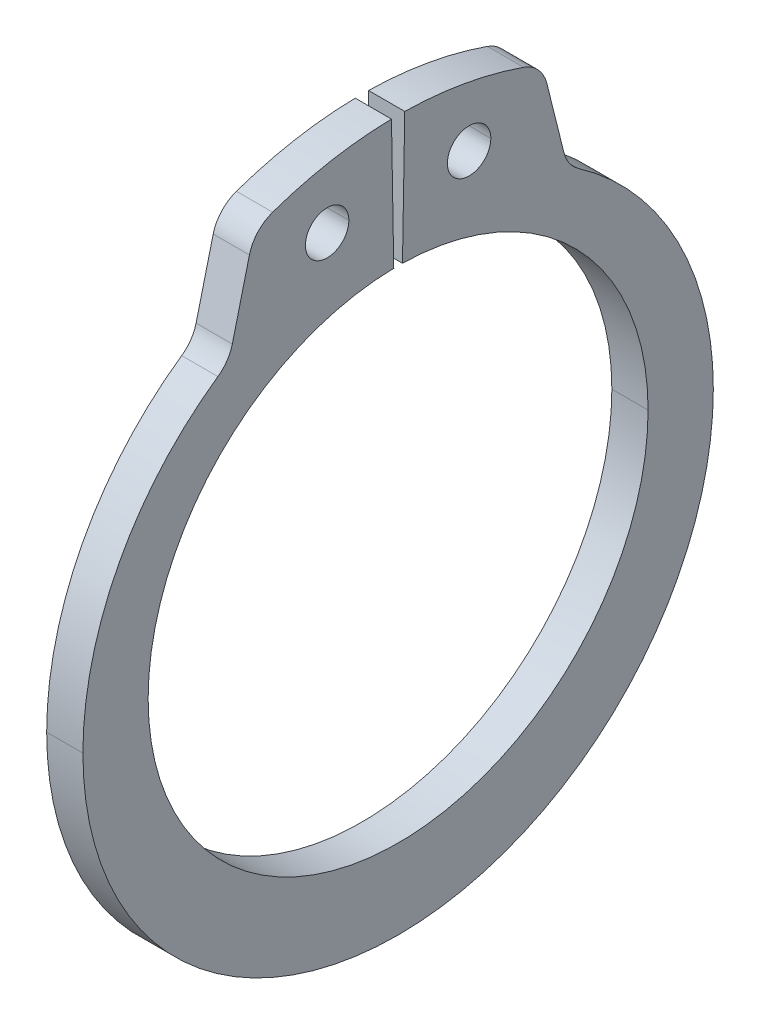
ISO-10303-21;
HEADER;
FILE_DESCRIPTION(('STEP AP214'),'2;1');
FILE_NAME('part.step','',(''),(''),'','','');
FILE_SCHEMA(('AUTOMOTIVE_DESIGN { 1 0 10303 214 1 1 1 1 }'));
ENDSEC;
DATA;
#1=APPLICATION_CONTEXT('core data for automotive mechanical design processes');
#2=APPLICATION_PROTOCOL_DEFINITION('international standard','automotive_design',2000,#1);
#3=PRODUCT_CONTEXT('',#1,'mechanical');
#4=PRODUCT('Part','Part','',(#3));
#5=PRODUCT_RELATED_PRODUCT_CATEGORY('part','',(#4));
#6=PRODUCT_DEFINITION_FORMATION('','',#4);
#7=PRODUCT_DEFINITION_CONTEXT('part definition',#1,'design');
#8=PRODUCT_DEFINITION('design','',#6,#7);
#9=PRODUCT_DEFINITION_SHAPE('','',#8);
#10=(LENGTH_UNIT() NAMED_UNIT(*) SI_UNIT(.MILLI.,.METRE.));
#11=(NAMED_UNIT(*) PLANE_ANGLE_UNIT() SI_UNIT($,.RADIAN.));
#12=(NAMED_UNIT(*) SI_UNIT($,.STERADIAN.) SOLID_ANGLE_UNIT());
#13=UNCERTAINTY_MEASURE_WITH_UNIT(LENGTH_MEASURE(1.E-05),#10,'distance_accuracy_value','');
#14=(GEOMETRIC_REPRESENTATION_CONTEXT(3) GLOBAL_UNCERTAINTY_ASSIGNED_CONTEXT((#13)) GLOBAL_UNIT_ASSIGNED_CONTEXT((#10,
#11,#12)) REPRESENTATION_CONTEXT('',''));
#15=CARTESIAN_POINT('',(0.,0.,0.));
#16=DIRECTION('',(0.,0.,1.));
#17=DIRECTION('',(1.,0.,0.));
#18=AXIS2_PLACEMENT_3D('',#15,#16,#17);
#19=CARTESIAN_POINT('',(0.5,7.55953720484558,-5.54645551751436));
#20=DIRECTION('',(-1.,0.,0.));
#21=DIRECTION('',(0.,0.,1.));
#22=AXIS2_PLACEMENT_3D('',#19,#20,#21);
#23=CYLINDRICAL_SURFACE('',#22,1.);
#24=CARTESIAN_POINT('',(0.5,7.55953720484558,-5.54645551751436));
#25=DIRECTION('',(-1.,0.,0.));
#26=DIRECTION('',(0.,0.,-1.));
#27=AXIS2_PLACEMENT_3D('',#24,#25,#26);
#28=CIRCLE('',#27,1.);
#29=CARTESIAN_POINT('',(0.5,6.73911195964233,-4.97470170945253));
#30=VERTEX_POINT('',#29);
#31=CARTESIAN_POINT('',(0.5,7.31761530924591,-4.57615979123836));
#32=VERTEX_POINT('',#31);
#33=EDGE_CURVE('E289',#30,#32,#28,.T.);
#34=ORIENTED_EDGE('',*,*,#33,.F.);
#35=DIRECTION('',(1.,0.,0.));
#36=VECTOR('',#35,1.);
#37=CARTESIAN_POINT('',(0.5,6.73911195964233,-4.97470170945253));
#38=LINE('',#37,#36);
#39=CARTESIAN_POINT('',(-0.5,6.73911195964233,-4.97470170945253));
#40=VERTEX_POINT('',#39);
#41=EDGE_CURVE('E259',#40,#30,#38,.T.);
#42=ORIENTED_EDGE('',*,*,#41,.F.);
#43=CARTESIAN_POINT('',(-0.5,7.55953720484558,-5.54645551751436));
#44=DIRECTION('',(1.,0.,0.));
#45=DIRECTION('',(0.,0.,-1.));
#46=AXIS2_PLACEMENT_3D('',#43,#44,#45);
#47=CIRCLE('',#46,1.);
#48=CARTESIAN_POINT('',(-0.5,7.31761530924591,-4.57615979123836));
#49=VERTEX_POINT('',#48);
#50=EDGE_CURVE('E343',#49,#40,#47,.T.);
#51=ORIENTED_EDGE('',*,*,#50,.F.);
#52=DIRECTION('',(-1.,0.,0.));
#53=VECTOR('',#52,1.);
#54=CARTESIAN_POINT('',(-0.5,7.31761530924591,-4.57615979123836));
#55=LINE('',#54,#53);
#56=EDGE_CURVE('E243',#32,#49,#55,.T.);
#57=ORIENTED_EDGE('',*,*,#56,.F.);
#58=EDGE_LOOP('',(#34,#42,#51,#57));
#59=FACE_BOUND('',#58,.T.);
#60=ADVANCED_FACE('F17',(#59),#23,.F.);
#61=CARTESIAN_POINT('',(0.5,8.96816184312502,-3.13401869099666));
#62=DIRECTION('',(-1.,0.,0.));
#63=DIRECTION('',(0.,0.,1.));
#64=AXIS2_PLACEMENT_3D('',#61,#62,#63);
#65=CYLINDRICAL_SURFACE('',#64,1.);
#66=CARTESIAN_POINT('',(0.5,8.96816184312502,-3.13401869099666));
#67=DIRECTION('',(1.,0.,0.));
#68=DIRECTION('',(0.,0.,-1.));
#69=AXIS2_PLACEMENT_3D('',#66,#67,#68);
#70=CIRCLE('',#69,1.);
#71=CARTESIAN_POINT('',(0.5,9.21008373872469,-4.10431441727265));
#72=VERTEX_POINT('',#71);
#73=CARTESIAN_POINT('',(0.5,9.91217887924345,-3.46391539531209));
#74=VERTEX_POINT('',#73);
#75=EDGE_CURVE('E195',#72,#74,#70,.T.);
#76=ORIENTED_EDGE('',*,*,#75,.F.);
#77=DIRECTION('',(1.,0.,0.));
#78=VECTOR('',#77,1.);
#79=CARTESIAN_POINT('',(0.5,9.21008373872469,-4.10431441727265));
#80=LINE('',#79,#78);
#81=CARTESIAN_POINT('',(-0.5,9.21008373872469,-4.10431441727265));
#82=VERTEX_POINT('',#81);
#83=EDGE_CURVE('E312',#82,#72,#80,.T.);
#84=ORIENTED_EDGE('',*,*,#83,.F.);
#85=CARTESIAN_POINT('',(-0.5,8.96816184312502,-3.13401869099666));
#86=DIRECTION('',(-1.,0.,0.));
#87=DIRECTION('',(0.,0.,-1.));
#88=AXIS2_PLACEMENT_3D('',#85,#86,#87);
#89=CIRCLE('',#88,1.);
#90=CARTESIAN_POINT('',(-0.5,9.91217887924345,-3.46391539531209));
#91=VERTEX_POINT('',#90);
#92=EDGE_CURVE('E383',#91,#82,#89,.T.);
#93=ORIENTED_EDGE('',*,*,#92,.F.);
#94=DIRECTION('',(-1.,0.,0.));
#95=VECTOR('',#94,1.);
#96=CARTESIAN_POINT('',(0.5,9.91217887924345,-3.46391539531209));
#97=LINE('',#96,#95);
#98=EDGE_CURVE('E27',#74,#91,#97,.T.);
#99=ORIENTED_EDGE('',*,*,#98,.F.);
#100=EDGE_LOOP('',(#76,#84,#93,#99));
#101=FACE_BOUND('',#100,.T.);
#102=ADVANCED_FACE('F428',(#101),#65,.T.);
#103=CARTESIAN_POINT('',(0.5,8.96816184312502,3.13401869099666));
#104=DIRECTION('',(-1.,0.,0.));
#105=DIRECTION('',(0.,0.,1.));
#106=AXIS2_PLACEMENT_3D('',#103,#104,#105);
#107=CYLINDRICAL_SURFACE('',#106,1.);
#108=CARTESIAN_POINT('',(0.5,8.96816184312502,3.13401869099666));
#109=DIRECTION('',(1.,0.,0.));
#110=DIRECTION('',(0.,0.,-1.));
#111=AXIS2_PLACEMENT_3D('',#108,#109,#110);
#112=CIRCLE('',#111,1.);
#113=CARTESIAN_POINT('',(0.5,9.91217887924345,3.46391539531209));
#114=VERTEX_POINT('',#113);
#115=CARTESIAN_POINT('',(0.5,9.21008373872469,4.10431441727265));
#116=VERTEX_POINT('',#115);
#117=EDGE_CURVE('E329',#114,#116,#112,.T.);
#118=ORIENTED_EDGE('',*,*,#117,.F.);
#119=DIRECTION('',(1.,0.,0.));
#120=VECTOR('',#119,1.);
#121=CARTESIAN_POINT('',(0.5,9.91217887924345,3.46391539531209));
#122=LINE('',#121,#120);
#123=CARTESIAN_POINT('',(-0.5,9.91217887924345,3.46391539531209));
#124=VERTEX_POINT('',#123);
#125=EDGE_CURVE('E240',#124,#114,#122,.T.);
#126=ORIENTED_EDGE('',*,*,#125,.F.);
#127=CARTESIAN_POINT('',(-0.5,8.96816184312502,3.13401869099666));
#128=DIRECTION('',(-1.,0.,0.));
#129=DIRECTION('',(0.,0.,-1.));
#130=AXIS2_PLACEMENT_3D('',#127,#128,#129);
#131=CIRCLE('',#130,1.);
#132=CARTESIAN_POINT('',(-0.5,9.21008373872469,4.10431441727265));
#133=VERTEX_POINT('',#132);
#134=EDGE_CURVE('E220',#133,#124,#131,.T.);
#135=ORIENTED_EDGE('',*,*,#134,.F.);
#136=DIRECTION('',(-1.,0.,0.));
#137=VECTOR('',#136,1.);
#138=CARTESIAN_POINT('',(0.5,9.21008373872469,4.10431441727265));
#139=LINE('',#138,#137);
#140=EDGE_CURVE('E239',#116,#133,#139,.T.);
#141=ORIENTED_EDGE('',*,*,#140,.F.);
#142=EDGE_LOOP('',(#118,#126,#135,#141));
#143=FACE_BOUND('',#142,.T.);
#144=ADVANCED_FACE('F467',(#143),#107,.T.);
#145=CARTESIAN_POINT('',(0.5,7.55953720484558,5.54645551751436));
#146=DIRECTION('',(-1.,0.,0.));
#147=DIRECTION('',(0.,0.,1.));
#148=AXIS2_PLACEMENT_3D('',#145,#146,#147);
#149=CYLINDRICAL_SURFACE('',#148,1.);
#150=CARTESIAN_POINT('',(0.5,7.55953720484558,5.54645551751436));
#151=DIRECTION('',(-1.,0.,0.));
#152=DIRECTION('',(0.,0.,-1.));
#153=AXIS2_PLACEMENT_3D('',#150,#151,#152);
#154=CIRCLE('',#153,1.);
#155=CARTESIAN_POINT('',(0.5,7.31761530924591,4.57615979123836));
#156=VERTEX_POINT('',#155);
#157=CARTESIAN_POINT('',(0.5,6.73911195964233,4.97470170945253));
#158=VERTEX_POINT('',#157);
#159=EDGE_CURVE('E355',#156,#158,#154,.T.);
#160=ORIENTED_EDGE('',*,*,#159,.F.);
#161=DIRECTION('',(1.,0.,0.));
#162=VECTOR('',#161,1.);
#163=CARTESIAN_POINT('',(0.5,7.31761530924591,4.57615979123836));
#164=LINE('',#163,#162);
#165=CARTESIAN_POINT('',(-0.5,7.31761530924591,4.57615979123836));
#166=VERTEX_POINT('',#165);
#167=EDGE_CURVE('E236',#166,#156,#164,.T.);
#168=ORIENTED_EDGE('',*,*,#167,.F.);
#169=CARTESIAN_POINT('',(-0.5,7.55953720484558,5.54645551751436));
#170=DIRECTION('',(1.,0.,0.));
#171=DIRECTION('',(0.,0.,-1.));
#172=AXIS2_PLACEMENT_3D('',#169,#170,#171);
#173=CIRCLE('',#172,1.);
#174=CARTESIAN_POINT('',(-0.5,6.73911195964233,4.97470170945253));
#175=VERTEX_POINT('',#174);
#176=EDGE_CURVE('E299',#175,#166,#173,.T.);
#177=ORIENTED_EDGE('',*,*,#176,.F.);
#178=DIRECTION('',(-1.,0.,0.));
#179=VECTOR('',#178,1.);
#180=CARTESIAN_POINT('',(0.5,6.73911195964233,4.97470170945253));
#181=LINE('',#180,#179);
#182=EDGE_CURVE('E42',#158,#175,#181,.T.);
#183=ORIENTED_EDGE('',*,*,#182,.F.);
#184=EDGE_LOOP('',(#160,#168,#177,#183));
#185=FACE_BOUND('',#184,.T.);
#186=ADVANCED_FACE('F472',(#185),#149,.F.);
#187=CARTESIAN_POINT('',(0.5,8.66711980549086,-1.9596288316201));
#188=DIRECTION('',(-1.,0.,0.));
#189=DIRECTION('',(0.,0.,1.));
#190=AXIS2_PLACEMENT_3D('',#187,#188,#189);
#191=CYLINDRICAL_SURFACE('',#190,0.6);
#192=DIRECTION('',(-1.,0.,0.));
#193=VECTOR('',#192,1.);
#194=CARTESIAN_POINT('',(0.5,8.66711980549086,-2.5596288316201));
#195=LINE('',#194,#193);
#196=CARTESIAN_POINT('',(0.5,8.66711980549086,-2.5596288316201));
#197=VERTEX_POINT('',#196);
#198=CARTESIAN_POINT('',(-0.5,8.66711980549086,-2.5596288316201));
#199=VERTEX_POINT('',#198);
#200=EDGE_CURVE('E313',#197,#199,#195,.T.);
#201=ORIENTED_EDGE('',*,*,#200,.F.);
#202=CARTESIAN_POINT('',(0.5,8.66711980549086,-1.9596288316201));
#203=DIRECTION('',(1.,0.,0.));
#204=DIRECTION('',(0.,0.,-1.));
#205=AXIS2_PLACEMENT_3D('',#202,#203,#204);
#206=CIRCLE('',#205,0.6);
#207=CARTESIAN_POINT('',(0.5,8.66711980549086,-1.3596288316201));
#208=VERTEX_POINT('',#207);
#209=EDGE_CURVE('E207',#197,#208,#206,.T.);
#210=ORIENTED_EDGE('',*,*,#209,.T.);
#211=DIRECTION('',(-1.,0.,0.));
#212=VECTOR('',#211,1.);
#213=CARTESIAN_POINT('',(0.5,8.66711980549086,-1.3596288316201));
#214=LINE('',#213,#212);
#215=CARTESIAN_POINT('',(-0.5,8.66711980549086,-1.3596288316201));
#216=VERTEX_POINT('',#215);
#217=EDGE_CURVE('E270',#208,#216,#214,.T.);
#218=ORIENTED_EDGE('',*,*,#217,.T.);
#219=CARTESIAN_POINT('',(-0.5,8.66711980549086,-1.9596288316201));
#220=DIRECTION('',(1.,0.,0.));
#221=DIRECTION('',(0.,0.,-1.));
#222=AXIS2_PLACEMENT_3D('',#219,#220,#221);
#223=CIRCLE('',#222,0.6);
#224=EDGE_CURVE('E20',#199,#216,#223,.T.);
#225=ORIENTED_EDGE('',*,*,#224,.F.);
#226=EDGE_LOOP('',(#201,#210,#218,#225));
#227=FACE_BOUND('',#226,.T.);
#228=ADVANCED_FACE('F548',(#227),#191,.F.);
#229=CARTESIAN_POINT('',(0.5,8.66711980549086,1.9596288316201));
#230=DIRECTION('',(-1.,0.,0.));
#231=DIRECTION('',(0.,0.,1.));
#232=AXIS2_PLACEMENT_3D('',#229,#230,#231);
#233=CYLINDRICAL_SURFACE('',#232,0.6);
#234=DIRECTION('',(-1.,0.,0.));
#235=VECTOR('',#234,1.);
#236=CARTESIAN_POINT('',(0.5,8.66711980549086,1.3596288316201));
#237=LINE('',#236,#235);
#238=CARTESIAN_POINT('',(0.5,8.66711980549086,1.3596288316201));
#239=VERTEX_POINT('',#238);
#240=CARTESIAN_POINT('',(-0.5,8.66711980549086,1.3596288316201));
#241=VERTEX_POINT('',#240);
#242=EDGE_CURVE('E249',#239,#241,#237,.T.);
#243=ORIENTED_EDGE('',*,*,#242,.F.);
#244=CARTESIAN_POINT('',(0.5,8.66711980549086,1.9596288316201));
#245=DIRECTION('',(1.,0.,0.));
#246=DIRECTION('',(0.,0.,-1.));
#247=AXIS2_PLACEMENT_3D('',#244,#245,#246);
#248=CIRCLE('',#247,0.6);
#249=CARTESIAN_POINT('',(0.5,8.66711980549086,2.5596288316201));
#250=VERTEX_POINT('',#249);
#251=EDGE_CURVE('E210',#239,#250,#248,.T.);
#252=ORIENTED_EDGE('',*,*,#251,.T.);
#253=DIRECTION('',(-1.,0.,0.));
#254=VECTOR('',#253,1.);
#255=CARTESIAN_POINT('',(0.5,8.66711980549086,2.5596288316201));
#256=LINE('',#255,#254);
#257=CARTESIAN_POINT('',(-0.5,8.66711980549086,2.5596288316201));
#258=VERTEX_POINT('',#257);
#259=EDGE_CURVE('E248',#250,#258,#256,.T.);
#260=ORIENTED_EDGE('',*,*,#259,.T.);
#261=CARTESIAN_POINT('',(-0.5,8.66711980549086,1.9596288316201));
#262=DIRECTION('',(1.,0.,0.));
#263=DIRECTION('',(0.,0.,-1.));
#264=AXIS2_PLACEMENT_3D('',#261,#262,#263);
#265=CIRCLE('',#264,0.6);
#266=EDGE_CURVE('E303',#241,#258,#265,.T.);
#267=ORIENTED_EDGE('',*,*,#266,.F.);
#268=EDGE_LOOP('',(#243,#252,#260,#267));
#269=FACE_BOUND('',#268,.T.);
#270=ADVANCED_FACE('F528',(#269),#233,.F.);
#271=CARTESIAN_POINT('',(0.5,10.4984007991421,-0.183250267591479));
#272=DIRECTION('',(0.,-0.0174524064372841,-0.999847695156391));
#273=DIRECTION('',(0.,-0.999847695156391,0.0174524064372841));
#274=AXIS2_PLACEMENT_3D('',#271,#272,#273);
#275=PLANE('',#274);
#276=DIRECTION('',(0.,-0.999847695156391,0.0174524064372841));
#277=VECTOR('',#276,1.);
#278=CARTESIAN_POINT('',(-0.5,10.4984007991421,-0.183250267591479));
#279=LINE('',#278,#277);
#280=CARTESIAN_POINT('',(-0.5,10.4984007991421,-0.183250267591479));
#281=VERTEX_POINT('',#280);
#282=CARTESIAN_POINT('',(-0.5,6.8989490965791,-0.120421604417256));
#283=VERTEX_POINT('',#282);
#284=EDGE_CURVE('E264',#281,#283,#279,.T.);
#285=ORIENTED_EDGE('',*,*,#284,.T.);
#286=DIRECTION('',(-1.,0.,0.));
#287=VECTOR('',#286,1.);
#288=CARTESIAN_POINT('',(0.5,6.8989490965791,-0.120421604417256));
#289=LINE('',#288,#287);
#290=CARTESIAN_POINT('',(0.5,6.8989490965791,-0.120421604417256));
#291=VERTEX_POINT('',#290);
#292=EDGE_CURVE('E185',#291,#283,#289,.T.);
#293=ORIENTED_EDGE('',*,*,#292,.F.);
#294=DIRECTION('',(0.,-0.999847695156391,0.0174524064372841));
#295=VECTOR('',#294,1.);
#296=CARTESIAN_POINT('',(0.5,10.4984007991421,-0.183250267591479));
#297=LINE('',#296,#295);
#298=CARTESIAN_POINT('',(0.5,10.4984007991421,-0.183250267591479));
#299=VERTEX_POINT('',#298);
#300=EDGE_CURVE('E183',#299,#291,#297,.T.);
#301=ORIENTED_EDGE('',*,*,#300,.F.);
#302=DIRECTION('',(-1.,0.,0.));
#303=VECTOR('',#302,1.);
#304=CARTESIAN_POINT('',(0.5,10.4984007991421,-0.183250267591479));
#305=LINE('',#304,#303);
#306=EDGE_CURVE('E11',#299,#281,#305,.T.);
#307=ORIENTED_EDGE('',*,*,#306,.T.);
#308=EDGE_LOOP('',(#285,#293,#301,#307));
#309=FACE_BOUND('',#308,.T.);
#310=ADVANCED_FACE('F184',(#309),#275,.F.);
#311=CARTESIAN_POINT('',(0.5,0.,0.));
#312=DIRECTION('',(-1.,0.,0.));
#313=DIRECTION('',(0.,0.,1.));
#314=AXIS2_PLACEMENT_3D('',#311,#312,#313);
#315=CYLINDRICAL_SURFACE('',#314,10.5);
#316=CARTESIAN_POINT('',(0.5,0.,0.));
#317=DIRECTION('',(1.,0.,0.));
#318=DIRECTION('',(0.,0.,1.));
#319=AXIS2_PLACEMENT_3D('',#316,#317,#318);
#320=CIRCLE('',#319,10.5);
#321=EDGE_CURVE('E175',#74,#299,#320,.T.);
#322=ORIENTED_EDGE('',*,*,#321,.F.);
#323=ORIENTED_EDGE('',*,*,#98,.T.);
#324=CARTESIAN_POINT('',(-0.5,0.,0.));
#325=DIRECTION('',(1.,0.,0.));
#326=DIRECTION('',(0.,0.,1.));
#327=AXIS2_PLACEMENT_3D('',#324,#325,#326);
#328=CIRCLE('',#327,10.5);
#329=EDGE_CURVE('E178',#91,#281,#328,.T.);
#330=ORIENTED_EDGE('',*,*,#329,.T.);
#331=ORIENTED_EDGE('',*,*,#306,.F.);
#332=EDGE_LOOP('',(#322,#323,#330,#331));
#333=FACE_BOUND('',#332,.T.);
#334=ADVANCED_FACE('F173',(#333),#315,.T.);
#335=CARTESIAN_POINT('',(0.5,9.71734472745919,-3.97784004803122));
#336=DIRECTION('',(0.,-0.241921895599666,0.970295726275997));
#337=DIRECTION('',(-1.,0.,0.));
#338=AXIS2_PLACEMENT_3D('',#335,#336,#337);
#339=PLANE('',#338);
#340=DIRECTION('',(0.,0.970295726275997,0.241921895599666));
#341=VECTOR('',#340,1.);
#342=CARTESIAN_POINT('',(-0.5,9.71734472745919,-3.97784004803122));
#343=LINE('',#342,#341);
#344=EDGE_CURVE('E380',#49,#82,#343,.T.);
#345=ORIENTED_EDGE('',*,*,#344,.T.);
#346=ORIENTED_EDGE('',*,*,#83,.T.);
#347=DIRECTION('',(0.,0.970295726275997,0.241921895599666));
#348=VECTOR('',#347,1.);
#349=CARTESIAN_POINT('',(0.5,9.71734472745919,-3.97784004803122));
#350=LINE('',#349,#348);
#351=EDGE_CURVE('E202',#32,#72,#350,.T.);
#352=ORIENTED_EDGE('',*,*,#351,.F.);
#353=ORIENTED_EDGE('',*,*,#56,.T.);
#354=EDGE_LOOP('',(#345,#346,#352,#353));
#355=FACE_BOUND('',#354,.T.);
#356=ADVANCED_FACE('F432',(#355),#339,.F.);
#357=CARTESIAN_POINT('',(0.5,-0.399224177769538,0.));
#358=DIRECTION('',(-1.,0.,0.));
#359=DIRECTION('',(0.,0.,1.));
#360=AXIS2_PLACEMENT_3D('',#357,#358,#359);
#361=CYLINDRICAL_SURFACE('',#360,8.70077582223046);
#362=DIRECTION('',(-1.,0.,0.));
#363=VECTOR('',#362,1.);
#364=CARTESIAN_POINT('',(0.5,-0.399224177769538,8.70077582223046));
#365=LINE('',#364,#363);
#366=CARTESIAN_POINT('',(0.5,-0.399224177769538,8.70077582223046));
#367=VERTEX_POINT('',#366);
#368=CARTESIAN_POINT('',(-0.5,-0.399224177769538,8.70077582223046));
#369=VERTEX_POINT('',#368);
#370=EDGE_CURVE('E258',#367,#369,#365,.T.);
#371=ORIENTED_EDGE('',*,*,#370,.F.);
#372=CARTESIAN_POINT('',(0.5,-0.399224177769538,0.));
#373=DIRECTION('',(1.,0.,0.));
#374=DIRECTION('',(0.,0.,-1.));
#375=AXIS2_PLACEMENT_3D('',#372,#373,#374);
#376=CIRCLE('',#375,8.70077582223046);
#377=EDGE_CURVE('E234',#158,#367,#376,.T.);
#378=ORIENTED_EDGE('',*,*,#377,.F.);
#379=ORIENTED_EDGE('',*,*,#182,.T.);
#380=CARTESIAN_POINT('',(-0.5,-0.399224177769538,0.));
#381=DIRECTION('',(1.,0.,0.));
#382=DIRECTION('',(0.,0.,-1.));
#383=AXIS2_PLACEMENT_3D('',#380,#381,#382);
#384=CIRCLE('',#383,8.70077582223046);
#385=EDGE_CURVE('E304',#175,#369,#384,.T.);
#386=ORIENTED_EDGE('',*,*,#385,.T.);
#387=EDGE_LOOP('',(#371,#378,#379,#386));
#388=FACE_BOUND('',#387,.T.);
#389=ADVANCED_FACE('F475',(#388),#361,.T.);
#390=CARTESIAN_POINT('',(0.5,9.71734472745919,3.97784004803122));
#391=DIRECTION('',(0.,-0.241921895599665,-0.970295726275997));
#392=DIRECTION('',(0.,-0.970295726275997,0.241921895599665));
#393=AXIS2_PLACEMENT_3D('',#390,#391,#392);
#394=PLANE('',#393);
#395=DIRECTION('',(0.,-0.970295726275997,0.241921895599665));
#396=VECTOR('',#395,1.);
#397=CARTESIAN_POINT('',(-0.5,9.71734472745919,3.97784004803122));
#398=LINE('',#397,#396);
#399=EDGE_CURVE('E209',#133,#166,#398,.T.);
#400=ORIENTED_EDGE('',*,*,#399,.T.);
#401=ORIENTED_EDGE('',*,*,#167,.T.);
#402=DIRECTION('',(0.,-0.970295726275997,0.241921895599665));
#403=VECTOR('',#402,1.);
#404=CARTESIAN_POINT('',(0.5,9.71734472745919,3.97784004803122));
#405=LINE('',#404,#403);
#406=EDGE_CURVE('E349',#116,#156,#405,.T.);
#407=ORIENTED_EDGE('',*,*,#406,.F.);
#408=ORIENTED_EDGE('',*,*,#140,.T.);
#409=EDGE_LOOP('',(#400,#401,#407,#408));
#410=FACE_BOUND('',#409,.T.);
#411=ADVANCED_FACE('F469',(#410),#394,.F.);
#412=CARTESIAN_POINT('',(0.5,0.,0.));
#413=DIRECTION('',(-1.,0.,0.));
#414=DIRECTION('',(0.,0.,1.));
#415=AXIS2_PLACEMENT_3D('',#412,#413,#414);
#416=CYLINDRICAL_SURFACE('',#415,10.5);
#417=CARTESIAN_POINT('',(-0.5,0.,0.));
#418=DIRECTION('',(1.,0.,0.));
#419=DIRECTION('',(0.,0.,-1.));
#420=AXIS2_PLACEMENT_3D('',#417,#418,#419);
#421=CIRCLE('',#420,10.5);
#422=CARTESIAN_POINT('',(-0.5,10.4984007991421,0.183250267591477));
#423=VERTEX_POINT('',#422);
#424=EDGE_CURVE('E253',#423,#124,#421,.T.);
#425=ORIENTED_EDGE('',*,*,#424,.T.);
#426=ORIENTED_EDGE('',*,*,#125,.T.);
#427=CARTESIAN_POINT('',(0.5,0.,0.));
#428=DIRECTION('',(1.,0.,0.));
#429=DIRECTION('',(0.,0.,-1.));
#430=AXIS2_PLACEMENT_3D('',#427,#428,#429);
#431=CIRCLE('',#430,10.5);
#432=CARTESIAN_POINT('',(0.5,10.4984007991421,0.183250267591477));
#433=VERTEX_POINT('',#432);
#434=EDGE_CURVE('E326',#433,#114,#431,.T.);
#435=ORIENTED_EDGE('',*,*,#434,.F.);
#436=DIRECTION('',(-1.,0.,0.));
#437=VECTOR('',#436,1.);
#438=CARTESIAN_POINT('',(0.5,10.4984007991421,0.183250267591477));
#439=LINE('',#438,#437);
#440=EDGE_CURVE('E273',#433,#423,#439,.T.);
#441=ORIENTED_EDGE('',*,*,#440,.T.);
#442=EDGE_LOOP('',(#425,#426,#435,#441));
#443=FACE_BOUND('',#442,.T.);
#444=ADVANCED_FACE('F478',(#443),#416,.T.);
#445=CARTESIAN_POINT('',(0.5,6.8989490965791,0.120421604417256));
#446=DIRECTION('',(0.,-0.0174524064372835,0.999847695156391));
#447=DIRECTION('',(-1.,0.,0.));
#448=AXIS2_PLACEMENT_3D('',#445,#446,#447);
#449=PLANE('',#448);
#450=DIRECTION('',(0.,0.999847695156391,0.0174524064372835));
#451=VECTOR('',#450,1.);
#452=CARTESIAN_POINT('',(-0.5,6.8989490965791,0.120421604417256));
#453=LINE('',#452,#451);
#454=CARTESIAN_POINT('',(-0.5,6.8989490965791,0.120421604417256));
#455=VERTEX_POINT('',#454);
#456=EDGE_CURVE('E265',#455,#423,#453,.T.);
#457=ORIENTED_EDGE('',*,*,#456,.T.);
#458=ORIENTED_EDGE('',*,*,#440,.F.);
#459=DIRECTION('',(0.,0.999847695156391,0.0174524064372835));
#460=VECTOR('',#459,1.);
#461=CARTESIAN_POINT('',(0.5,6.8989490965791,0.120421604417256));
#462=LINE('',#461,#460);
#463=CARTESIAN_POINT('',(0.5,6.8989490965791,0.120421604417256));
#464=VERTEX_POINT('',#463);
#465=EDGE_CURVE('E205',#464,#433,#462,.T.);
#466=ORIENTED_EDGE('',*,*,#465,.F.);
#467=DIRECTION('',(-1.,0.,0.));
#468=VECTOR('',#467,1.);
#469=CARTESIAN_POINT('',(0.5,6.8989490965791,0.120421604417256));
#470=LINE('',#469,#468);
#471=EDGE_CURVE('E330',#464,#455,#470,.T.);
#472=ORIENTED_EDGE('',*,*,#471,.T.);
#473=EDGE_LOOP('',(#457,#458,#466,#472));
#474=FACE_BOUND('',#473,.T.);
#475=ADVANCED_FACE('F482',(#474),#449,.F.);
#476=CARTESIAN_POINT('',(0.5,0.,0.));
#477=DIRECTION('',(-1.,0.,0.));
#478=DIRECTION('',(0.,0.,1.));
#479=AXIS2_PLACEMENT_3D('',#476,#477,#478);
#480=CYLINDRICAL_SURFACE('',#479,6.9);
#481=DIRECTION('',(-1.,0.,0.));
#482=VECTOR('',#481,1.);
#483=CARTESIAN_POINT('',(0.5,0.,-6.9));
#484=LINE('',#483,#482);
#485=CARTESIAN_POINT('',(0.5,0.,-6.9));
#486=VERTEX_POINT('',#485);
#487=CARTESIAN_POINT('',(-0.5,0.,-6.9));
#488=VERTEX_POINT('',#487);
#489=EDGE_CURVE('E288',#486,#488,#484,.T.);
#490=ORIENTED_EDGE('',*,*,#489,.F.);
#491=CARTESIAN_POINT('',(0.5,0.,0.));
#492=DIRECTION('',(-1.,0.,0.));
#493=DIRECTION('',(0.,0.,-1.));
#494=AXIS2_PLACEMENT_3D('',#491,#492,#493);
#495=CIRCLE('',#494,6.9);
#496=EDGE_CURVE('E189',#291,#486,#495,.T.);
#497=ORIENTED_EDGE('',*,*,#496,.F.);
#498=ORIENTED_EDGE('',*,*,#292,.T.);
#499=CARTESIAN_POINT('',(-0.5,0.,0.));
#500=DIRECTION('',(-1.,0.,0.));
#501=DIRECTION('',(0.,0.,-1.));
#502=AXIS2_PLACEMENT_3D('',#499,#500,#501);
#503=CIRCLE('',#502,6.9);
#504=EDGE_CURVE('E260',#283,#488,#503,.T.);
#505=ORIENTED_EDGE('',*,*,#504,.T.);
#506=EDGE_LOOP('',(#490,#497,#498,#505));
#507=FACE_BOUND('',#506,.T.);
#508=ADVANCED_FACE('F495',(#507),#480,.F.);
#509=CARTESIAN_POINT('',(-0.5,0.,0.));
#510=DIRECTION('',(1.,0.,0.));
#511=DIRECTION('',(0.,1.,0.));
#512=AXIS2_PLACEMENT_3D('',#509,#510,#511);
#513=PLANE('',#512);
#514=CARTESIAN_POINT('',(-0.5,8.66711980549086,-1.9596288316201));
#515=DIRECTION('',(1.,0.,0.));
#516=DIRECTION('',(0.,0.,-1.));
#517=AXIS2_PLACEMENT_3D('',#514,#515,#516);
#518=CIRCLE('',#517,0.6);
#519=EDGE_CURVE('E317',#216,#199,#518,.T.);
#520=ORIENTED_EDGE('',*,*,#519,.T.);
#521=ORIENTED_EDGE('',*,*,#224,.T.);
#522=EDGE_LOOP('',(#520,#521));
#523=FACE_BOUND('',#522,.T.);
#524=CARTESIAN_POINT('',(-0.5,8.66711980549086,1.9596288316201));
#525=DIRECTION('',(1.,0.,0.));
#526=DIRECTION('',(0.,0.,-1.));
#527=AXIS2_PLACEMENT_3D('',#524,#525,#526);
#528=CIRCLE('',#527,0.6);
#529=EDGE_CURVE('E244',#258,#241,#528,.T.);
#530=ORIENTED_EDGE('',*,*,#529,.T.);
#531=ORIENTED_EDGE('',*,*,#266,.T.);
#532=EDGE_LOOP('',(#530,#531));
#533=FACE_BOUND('',#532,.T.);
#534=ORIENTED_EDGE('',*,*,#399,.F.);
#535=ORIENTED_EDGE('',*,*,#134,.T.);
#536=ORIENTED_EDGE('',*,*,#424,.F.);
#537=ORIENTED_EDGE('',*,*,#456,.F.);
#538=CARTESIAN_POINT('',(-0.5,0.,0.));
#539=DIRECTION('',(-1.,0.,0.));
#540=DIRECTION('',(0.,0.,-1.));
#541=AXIS2_PLACEMENT_3D('',#538,#539,#540);
#542=CIRCLE('',#541,6.9);
#543=CARTESIAN_POINT('',(-0.5,0.,6.9));
#544=VERTEX_POINT('',#543);
#545=EDGE_CURVE('E335',#544,#455,#542,.T.);
#546=ORIENTED_EDGE('',*,*,#545,.F.);
#547=CARTESIAN_POINT('',(-0.5,0.,0.));
#548=DIRECTION('',(-1.,0.,0.));
#549=DIRECTION('',(0.,0.,-1.));
#550=AXIS2_PLACEMENT_3D('',#547,#548,#549);
#551=CIRCLE('',#550,6.9);
#552=EDGE_CURVE('E283',#488,#544,#551,.T.);
#553=ORIENTED_EDGE('',*,*,#552,.F.);
#554=ORIENTED_EDGE('',*,*,#504,.F.);
#555=ORIENTED_EDGE('',*,*,#284,.F.);
#556=ORIENTED_EDGE('',*,*,#329,.F.);
#557=ORIENTED_EDGE('',*,*,#92,.T.);
#558=ORIENTED_EDGE('',*,*,#344,.F.);
#559=ORIENTED_EDGE('',*,*,#50,.T.);
#560=CARTESIAN_POINT('',(-0.5,-0.399224177769538,0.));
#561=DIRECTION('',(1.,0.,0.));
#562=DIRECTION('',(0.,0.,-1.));
#563=AXIS2_PLACEMENT_3D('',#560,#561,#562);
#564=CIRCLE('',#563,8.70077582223046);
#565=CARTESIAN_POINT('',(-0.5,-0.399224177769537,-8.70077582223046));
#566=VERTEX_POINT('',#565);
#567=EDGE_CURVE('E298',#566,#40,#564,.T.);
#568=ORIENTED_EDGE('',*,*,#567,.F.);
#569=CARTESIAN_POINT('',(-0.5,-0.399224177769538,0.));
#570=DIRECTION('',(1.,0.,0.));
#571=DIRECTION('',(0.,0.,-1.));
#572=AXIS2_PLACEMENT_3D('',#569,#570,#571);
#573=CIRCLE('',#572,8.70077582223046);
#574=EDGE_CURVE('E277',#369,#566,#573,.T.);
#575=ORIENTED_EDGE('',*,*,#574,.F.);
#576=ORIENTED_EDGE('',*,*,#385,.F.);
#577=ORIENTED_EDGE('',*,*,#176,.T.);
#578=EDGE_LOOP('',(#534,#535,#536,#537,#546,#553,#554,#555,#556,#557,#558,#559,#568,#575,#576,#577));
#579=FACE_BOUND('',#578,.T.);
#580=ADVANCED_FACE('F423',(#523,#533,#579),#513,.F.);
#581=CARTESIAN_POINT('',(0.5,0.,0.));
#582=DIRECTION('',(1.,0.,0.));
#583=DIRECTION('',(0.,1.,0.));
#584=AXIS2_PLACEMENT_3D('',#581,#582,#583);
#585=PLANE('',#584);
#586=CARTESIAN_POINT('',(0.5,8.66711980549086,-1.9596288316201));
#587=DIRECTION('',(1.,0.,0.));
#588=DIRECTION('',(0.,0.,-1.));
#589=AXIS2_PLACEMENT_3D('',#586,#587,#588);
#590=CIRCLE('',#589,0.6);
#591=EDGE_CURVE('E318',#208,#197,#590,.T.);
#592=ORIENTED_EDGE('',*,*,#591,.F.);
#593=ORIENTED_EDGE('',*,*,#209,.F.);
#594=EDGE_LOOP('',(#592,#593));
#595=FACE_BOUND('',#594,.T.);
#596=CARTESIAN_POINT('',(0.5,8.66711980549086,1.9596288316201));
#597=DIRECTION('',(1.,0.,0.));
#598=DIRECTION('',(0.,0.,-1.));
#599=AXIS2_PLACEMENT_3D('',#596,#597,#598);
#600=CIRCLE('',#599,0.6);
#601=EDGE_CURVE('E266',#250,#239,#600,.T.);
#602=ORIENTED_EDGE('',*,*,#601,.F.);
#603=ORIENTED_EDGE('',*,*,#251,.F.);
#604=EDGE_LOOP('',(#602,#603));
#605=FACE_BOUND('',#604,.T.);
#606=ORIENTED_EDGE('',*,*,#434,.T.);
#607=ORIENTED_EDGE('',*,*,#117,.T.);
#608=ORIENTED_EDGE('',*,*,#406,.T.);
#609=ORIENTED_EDGE('',*,*,#159,.T.);
#610=ORIENTED_EDGE('',*,*,#377,.T.);
#611=CARTESIAN_POINT('',(0.5,-0.399224177769538,0.));
#612=DIRECTION('',(1.,0.,0.));
#613=DIRECTION('',(0.,0.,-1.));
#614=AXIS2_PLACEMENT_3D('',#611,#612,#613);
#615=CIRCLE('',#614,8.70077582223046);
#616=CARTESIAN_POINT('',(0.5,-0.399224177769537,-8.70077582223046));
#617=VERTEX_POINT('',#616);
#618=EDGE_CURVE('E254',#367,#617,#615,.T.);
#619=ORIENTED_EDGE('',*,*,#618,.T.);
#620=CARTESIAN_POINT('',(0.5,-0.399224177769538,0.));
#621=DIRECTION('',(1.,0.,0.));
#622=DIRECTION('',(0.,0.,-1.));
#623=AXIS2_PLACEMENT_3D('',#620,#621,#622);
#624=CIRCLE('',#623,8.70077582223046);
#625=EDGE_CURVE('E278',#617,#30,#624,.T.);
#626=ORIENTED_EDGE('',*,*,#625,.T.);
#627=ORIENTED_EDGE('',*,*,#33,.T.);
#628=ORIENTED_EDGE('',*,*,#351,.T.);
#629=ORIENTED_EDGE('',*,*,#75,.T.);
#630=ORIENTED_EDGE('',*,*,#321,.T.);
#631=ORIENTED_EDGE('',*,*,#300,.T.);
#632=ORIENTED_EDGE('',*,*,#496,.T.);
#633=CARTESIAN_POINT('',(0.5,0.,0.));
#634=DIRECTION('',(-1.,0.,0.));
#635=DIRECTION('',(0.,0.,-1.));
#636=AXIS2_PLACEMENT_3D('',#633,#634,#635);
#637=CIRCLE('',#636,6.9);
#638=CARTESIAN_POINT('',(0.5,0.,6.9));
#639=VERTEX_POINT('',#638);
#640=EDGE_CURVE('E325',#486,#639,#637,.T.);
#641=ORIENTED_EDGE('',*,*,#640,.T.);
#642=CARTESIAN_POINT('',(0.5,0.,0.));
#643=DIRECTION('',(-1.,0.,0.));
#644=DIRECTION('',(0.,0.,-1.));
#645=AXIS2_PLACEMENT_3D('',#642,#643,#644);
#646=CIRCLE('',#645,6.9);
#647=EDGE_CURVE('E331',#639,#464,#646,.T.);
#648=ORIENTED_EDGE('',*,*,#647,.T.);
#649=ORIENTED_EDGE('',*,*,#465,.T.);
#650=EDGE_LOOP('',(#606,#607,#608,#609,#610,#619,#626,#627,#628,#629,#630,#631,#632,#641,#648,#649));
#651=FACE_BOUND('',#650,.T.);
#652=ADVANCED_FACE('F192',(#595,#605,#651),#585,.T.);
#653=CARTESIAN_POINT('',(0.5,0.,0.));
#654=DIRECTION('',(-1.,0.,0.));
#655=DIRECTION('',(0.,0.,1.));
#656=AXIS2_PLACEMENT_3D('',#653,#654,#655);
#657=CYLINDRICAL_SURFACE('',#656,6.9);
#658=ORIENTED_EDGE('',*,*,#647,.F.);
#659=DIRECTION('',(-1.,0.,0.));
#660=VECTOR('',#659,1.);
#661=CARTESIAN_POINT('',(0.5,0.,6.9));
#662=LINE('',#661,#660);
#663=EDGE_CURVE('E287',#639,#544,#662,.T.);
#664=ORIENTED_EDGE('',*,*,#663,.T.);
#665=ORIENTED_EDGE('',*,*,#545,.T.);
#666=ORIENTED_EDGE('',*,*,#471,.F.);
#667=EDGE_LOOP('',(#658,#664,#665,#666));
#668=FACE_BOUND('',#667,.T.);
#669=ADVANCED_FACE('F485',(#668),#657,.F.);
#670=CARTESIAN_POINT('',(0.5,0.,0.));
#671=DIRECTION('',(-1.,0.,0.));
#672=DIRECTION('',(0.,0.,1.));
#673=AXIS2_PLACEMENT_3D('',#670,#671,#672);
#674=CYLINDRICAL_SURFACE('',#673,6.9);
#675=ORIENTED_EDGE('',*,*,#640,.F.);
#676=ORIENTED_EDGE('',*,*,#489,.T.);
#677=ORIENTED_EDGE('',*,*,#552,.T.);
#678=ORIENTED_EDGE('',*,*,#663,.F.);
#679=EDGE_LOOP('',(#675,#676,#677,#678));
#680=FACE_BOUND('',#679,.T.);
#681=ADVANCED_FACE('F493',(#680),#674,.F.);
#682=CARTESIAN_POINT('',(0.5,-0.399224177769538,0.));
#683=DIRECTION('',(-1.,0.,0.));
#684=DIRECTION('',(0.,0.,1.));
#685=AXIS2_PLACEMENT_3D('',#682,#683,#684);
#686=CYLINDRICAL_SURFACE('',#685,8.70077582223046);
#687=DIRECTION('',(-1.,0.,0.));
#688=VECTOR('',#687,1.);
#689=CARTESIAN_POINT('',(0.5,-0.399224177769537,-8.70077582223046));
#690=LINE('',#689,#688);
#691=EDGE_CURVE('E282',#617,#566,#690,.T.);
#692=ORIENTED_EDGE('',*,*,#691,.F.);
#693=ORIENTED_EDGE('',*,*,#618,.F.);
#694=ORIENTED_EDGE('',*,*,#370,.T.);
#695=ORIENTED_EDGE('',*,*,#574,.T.);
#696=EDGE_LOOP('',(#692,#693,#694,#695));
#697=FACE_BOUND('',#696,.T.);
#698=ADVANCED_FACE('F446',(#697),#686,.T.);
#699=CARTESIAN_POINT('',(0.5,-0.399224177769538,0.));
#700=DIRECTION('',(-1.,0.,0.));
#701=DIRECTION('',(0.,0.,1.));
#702=AXIS2_PLACEMENT_3D('',#699,#700,#701);
#703=CYLINDRICAL_SURFACE('',#702,8.70077582223046);
#704=ORIENTED_EDGE('',*,*,#625,.F.);
#705=ORIENTED_EDGE('',*,*,#691,.T.);
#706=ORIENTED_EDGE('',*,*,#567,.T.);
#707=ORIENTED_EDGE('',*,*,#41,.T.);
#708=EDGE_LOOP('',(#704,#705,#706,#707));
#709=FACE_BOUND('',#708,.T.);
#710=ADVANCED_FACE('F443',(#709),#703,.T.);
#711=CARTESIAN_POINT('',(0.5,8.66711980549086,1.9596288316201));
#712=DIRECTION('',(-1.,0.,0.));
#713=DIRECTION('',(0.,0.,1.));
#714=AXIS2_PLACEMENT_3D('',#711,#712,#713);
#715=CYLINDRICAL_SURFACE('',#714,0.6);
#716=ORIENTED_EDGE('',*,*,#601,.T.);
#717=ORIENTED_EDGE('',*,*,#242,.T.);
#718=ORIENTED_EDGE('',*,*,#529,.F.);
#719=ORIENTED_EDGE('',*,*,#259,.F.);
#720=EDGE_LOOP('',(#716,#717,#718,#719));
#721=FACE_BOUND('',#720,.T.);
#722=ADVANCED_FACE('F583',(#721),#715,.F.);
#723=CARTESIAN_POINT('',(0.5,8.66711980549086,-1.9596288316201));
#724=DIRECTION('',(-1.,0.,0.));
#725=DIRECTION('',(0.,0.,1.));
#726=AXIS2_PLACEMENT_3D('',#723,#724,#725);
#727=CYLINDRICAL_SURFACE('',#726,0.6);
#728=ORIENTED_EDGE('',*,*,#591,.T.);
#729=ORIENTED_EDGE('',*,*,#200,.T.);
#730=ORIENTED_EDGE('',*,*,#519,.F.);
#731=ORIENTED_EDGE('',*,*,#217,.F.);
#732=EDGE_LOOP('',(#728,#729,#730,#731));
#733=FACE_BOUND('',#732,.T.);
#734=ADVANCED_FACE('F578',(#733),#727,.F.);
#735=CLOSED_SHELL('',(#60,#102,#144,#186,#228,#270,#310,#334,#356,#389,#411,#444,#475,#508,#580,
#652,#669,#681,#698,#710,#722,#734));
#736=MANIFOLD_SOLID_BREP('B1',#735);
#737=ADVANCED_BREP_SHAPE_REPRESENTATION('',(#18,#736),#14);
#738=SHAPE_DEFINITION_REPRESENTATION(#9,#737);
ENDSEC;
END-ISO-10303-21;
